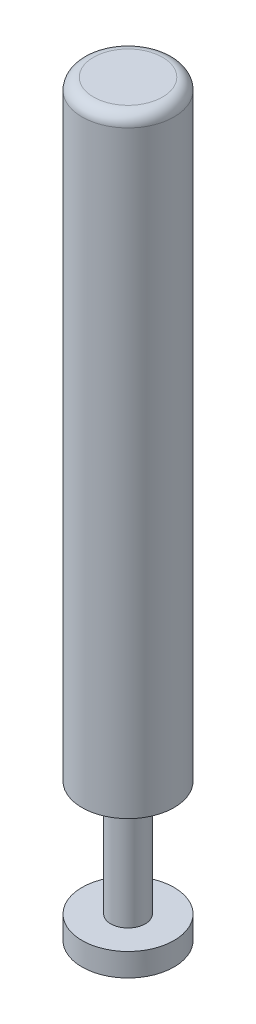
ISO-10303-21;
HEADER;
FILE_DESCRIPTION(('STEP AP214'),'2;1');
FILE_NAME('part.step','',(''),(''),'','','');
FILE_SCHEMA(('AUTOMOTIVE_DESIGN { 1 0 10303 214 1 1 1 1 }'));
ENDSEC;
DATA;
#1=APPLICATION_CONTEXT('core data for automotive mechanical design processes');
#2=APPLICATION_PROTOCOL_DEFINITION('international standard','automotive_design',2000,#1);
#3=PRODUCT_CONTEXT('',#1,'mechanical');
#4=PRODUCT('Part','Part','',(#3));
#5=PRODUCT_RELATED_PRODUCT_CATEGORY('part','',(#4));
#6=PRODUCT_DEFINITION_FORMATION('','',#4);
#7=PRODUCT_DEFINITION_CONTEXT('part definition',#1,'design');
#8=PRODUCT_DEFINITION('design','',#6,#7);
#9=PRODUCT_DEFINITION_SHAPE('','',#8);
#10=(LENGTH_UNIT() NAMED_UNIT(*) SI_UNIT(.MILLI.,.METRE.));
#11=(NAMED_UNIT(*) PLANE_ANGLE_UNIT() SI_UNIT($,.RADIAN.));
#12=(NAMED_UNIT(*) SI_UNIT($,.STERADIAN.) SOLID_ANGLE_UNIT());
#13=UNCERTAINTY_MEASURE_WITH_UNIT(LENGTH_MEASURE(1.E-05),#10,'distance_accuracy_value','');
#14=(GEOMETRIC_REPRESENTATION_CONTEXT(3) GLOBAL_UNCERTAINTY_ASSIGNED_CONTEXT((#13)) GLOBAL_UNIT_ASSIGNED_CONTEXT((#10,
#11,#12)) REPRESENTATION_CONTEXT('',''));
#15=CARTESIAN_POINT('',(0.,0.,0.));
#16=DIRECTION('',(0.,0.,1.));
#17=DIRECTION('',(1.,0.,0.));
#18=AXIS2_PLACEMENT_3D('',#15,#16,#17);
#19=CARTESIAN_POINT('',(0.,32.5,0.));
#20=DIRECTION('',(0.,-1.,0.));
#21=DIRECTION('',(0.,0.,-1.));
#22=AXIS2_PLACEMENT_3D('',#19,#20,#21);
#23=CYLINDRICAL_SURFACE('',#22,2.);
#24=CARTESIAN_POINT('',(0.,32.,0.));
#25=DIRECTION('',(0.,1.,0.));
#26=DIRECTION('',(0.,0.,1.));
#27=AXIS2_PLACEMENT_3D('',#24,#25,#26);
#28=CIRCLE('',#27,2.);
#29=CARTESIAN_POINT('',(0.,32.,2.));
#30=VERTEX_POINT('',#29);
#31=EDGE_CURVE('E10',#30,#30,#28,.F.);
#32=ORIENTED_EDGE('',*,*,#31,.T.);
#33=EDGE_LOOP('',(#32));
#34=FACE_BOUND('',#33,.T.);
#35=CARTESIAN_POINT('',(0.,6.,0.));
#36=DIRECTION('',(0.,-1.,0.));
#37=DIRECTION('',(0.,0.,-1.));
#38=AXIS2_PLACEMENT_3D('',#35,#36,#37);
#39=CIRCLE('',#38,2.);
#40=CARTESIAN_POINT('',(0.,6.,-2.));
#41=VERTEX_POINT('',#40);
#42=EDGE_CURVE('E48',#41,#41,#39,.T.);
#43=ORIENTED_EDGE('',*,*,#42,.F.);
#44=EDGE_LOOP('',(#43));
#45=FACE_BOUND('',#44,.T.);
#46=ADVANCED_FACE('F33',(#34,#45),#23,.T.);
#47=CARTESIAN_POINT('',(0.,32.5,0.));
#48=DIRECTION('',(0.,1.,0.));
#49=DIRECTION('',(0.,0.,1.));
#50=AXIS2_PLACEMENT_3D('',#47,#48,#49);
#51=PLANE('',#50);
#52=CARTESIAN_POINT('',(0.,32.5,0.));
#53=DIRECTION('',(0.,1.,0.));
#54=DIRECTION('',(0.,0.,1.));
#55=AXIS2_PLACEMENT_3D('',#52,#53,#54);
#56=CIRCLE('',#55,1.5);
#57=CARTESIAN_POINT('',(0.,32.5,1.5));
#58=VERTEX_POINT('',#57);
#59=EDGE_CURVE('E40',#58,#58,#56,.T.);
#60=ORIENTED_EDGE('',*,*,#59,.T.);
#61=EDGE_LOOP('',(#60));
#62=FACE_BOUND('',#61,.T.);
#63=ADVANCED_FACE('F74',(#62),#51,.T.);
#64=CARTESIAN_POINT('',(0.,6.,0.));
#65=DIRECTION('',(0.,-1.,0.));
#66=DIRECTION('',(0.,0.,-1.));
#67=AXIS2_PLACEMENT_3D('',#64,#65,#66);
#68=CYLINDRICAL_SURFACE('',#67,0.75);
#69=CARTESIAN_POINT('',(0.,6.,0.));
#70=DIRECTION('',(0.,-1.,0.));
#71=DIRECTION('',(0.,0.,-1.));
#72=AXIS2_PLACEMENT_3D('',#69,#70,#71);
#73=CIRCLE('',#72,0.75);
#74=CARTESIAN_POINT('',(0.,6.,-0.75));
#75=VERTEX_POINT('',#74);
#76=EDGE_CURVE('E54',#75,#75,#73,.T.);
#77=ORIENTED_EDGE('',*,*,#76,.T.);
#78=EDGE_LOOP('',(#77));
#79=FACE_BOUND('',#78,.T.);
#80=CARTESIAN_POINT('',(0.,1.,0.));
#81=DIRECTION('',(0.,-1.,0.));
#82=DIRECTION('',(0.,0.,-1.));
#83=AXIS2_PLACEMENT_3D('',#80,#81,#82);
#84=CIRCLE('',#83,0.75);
#85=CARTESIAN_POINT('',(0.,1.,-0.75));
#86=VERTEX_POINT('',#85);
#87=EDGE_CURVE('E55',#86,#86,#84,.T.);
#88=ORIENTED_EDGE('',*,*,#87,.F.);
#89=EDGE_LOOP('',(#88));
#90=FACE_BOUND('',#89,.T.);
#91=ADVANCED_FACE('F63',(#79,#90),#68,.T.);
#92=CARTESIAN_POINT('',(0.,6.,0.));
#93=DIRECTION('',(0.,-1.,0.));
#94=DIRECTION('',(0.,0.,-1.));
#95=AXIS2_PLACEMENT_3D('',#92,#93,#94);
#96=PLANE('',#95);
#97=ORIENTED_EDGE('',*,*,#76,.F.);
#98=EDGE_LOOP('',(#97));
#99=FACE_BOUND('',#98,.T.);
#100=ORIENTED_EDGE('',*,*,#42,.T.);
#101=EDGE_LOOP('',(#100));
#102=FACE_BOUND('',#101,.T.);
#103=ADVANCED_FACE('F66',(#99,#102),#96,.T.);
#104=CARTESIAN_POINT('',(0.,1.,0.));
#105=DIRECTION('',(0.,-1.,0.));
#106=DIRECTION('',(0.,0.,-1.));
#107=AXIS2_PLACEMENT_3D('',#104,#105,#106);
#108=PLANE('',#107);
#109=ORIENTED_EDGE('',*,*,#87,.T.);
#110=EDGE_LOOP('',(#109));
#111=FACE_BOUND('',#110,.T.);
#112=CARTESIAN_POINT('',(0.,1.,0.));
#113=DIRECTION('',(0.,-1.,0.));
#114=DIRECTION('',(0.,0.,-1.));
#115=AXIS2_PLACEMENT_3D('',#112,#113,#114);
#116=CIRCLE('',#115,2.);
#117=CARTESIAN_POINT('',(0.,1.,-2.));
#118=VERTEX_POINT('',#117);
#119=EDGE_CURVE('E51',#118,#118,#116,.T.);
#120=ORIENTED_EDGE('',*,*,#119,.F.);
#121=EDGE_LOOP('',(#120));
#122=FACE_BOUND('',#121,.T.);
#123=ADVANCED_FACE('F69',(#111,#122),#108,.F.);
#124=CARTESIAN_POINT('',(0.,0.,0.));
#125=DIRECTION('',(0.,1.,0.));
#126=DIRECTION('',(0.,0.,1.));
#127=AXIS2_PLACEMENT_3D('',#124,#125,#126);
#128=PLANE('',#127);
#129=CARTESIAN_POINT('',(0.,0.,0.));
#130=DIRECTION('',(0.,1.,0.));
#131=DIRECTION('',(0.,0.,1.));
#132=AXIS2_PLACEMENT_3D('',#129,#130,#131);
#133=CIRCLE('',#132,2.);
#134=CARTESIAN_POINT('',(0.,0.,2.));
#135=VERTEX_POINT('',#134);
#136=EDGE_CURVE('E44',#135,#135,#133,.T.);
#137=ORIENTED_EDGE('',*,*,#136,.F.);
#138=EDGE_LOOP('',(#137));
#139=FACE_BOUND('',#138,.T.);
#140=ADVANCED_FACE('F82',(#139),#128,.F.);
#141=ORIENTED_EDGE('',*,*,#119,.T.);
#142=EDGE_LOOP('',(#141));
#143=FACE_BOUND('',#142,.T.);
#144=ORIENTED_EDGE('',*,*,#136,.T.);
#145=EDGE_LOOP('',(#144));
#146=FACE_BOUND('',#145,.T.);
#147=ADVANCED_FACE('F75',(#143,#146),#23,.T.);
#148=CARTESIAN_POINT('',(0.,32.,0.));
#149=DIRECTION('',(0.,1.,0.));
#150=DIRECTION('',(0.,0.,1.));
#151=AXIS2_PLACEMENT_3D('',#148,#149,#150);
#152=TOROIDAL_SURFACE('',#151,1.5,0.5);
#153=ORIENTED_EDGE('',*,*,#31,.F.);
#154=EDGE_LOOP('',(#153));
#155=FACE_BOUND('',#154,.T.);
#156=ORIENTED_EDGE('',*,*,#59,.F.);
#157=EDGE_LOOP('',(#156));
#158=FACE_BOUND('',#157,.T.);
#159=ADVANCED_FACE('F35',(#155,#158),#152,.T.);
#160=CLOSED_SHELL('',(#46,#63,#91,#103,#123,#140,#147,#159));
#161=MANIFOLD_SOLID_BREP('B2',#160);
#162=ADVANCED_BREP_SHAPE_REPRESENTATION('',(#18,#161),#14);
#163=SHAPE_DEFINITION_REPRESENTATION(#9,#162);
ENDSEC;
END-ISO-10303-21;
